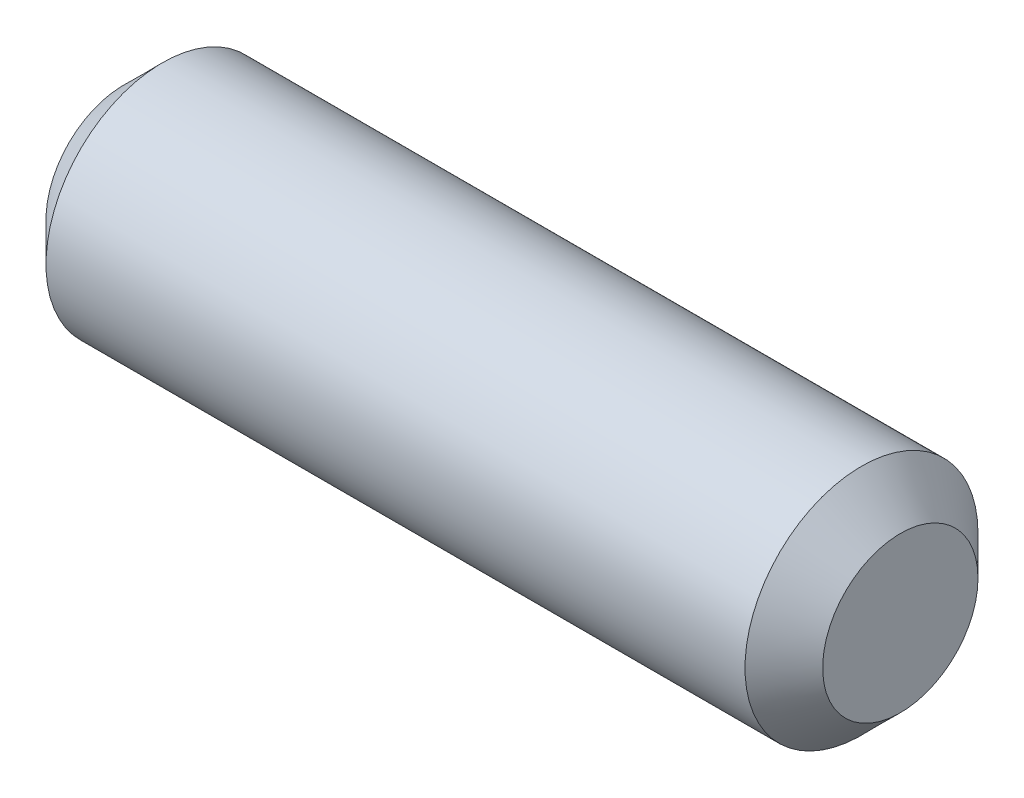
ISO-10303-21;
HEADER;
FILE_DESCRIPTION(('STEP AP214'),'2;1');
FILE_NAME('part.step','',(''),(''),'','','');
FILE_SCHEMA(('AUTOMOTIVE_DESIGN { 1 0 10303 214 1 1 1 1 }'));
ENDSEC;
DATA;
#1=APPLICATION_CONTEXT('core data for automotive mechanical design processes');
#2=APPLICATION_PROTOCOL_DEFINITION('international standard','automotive_design',2000,#1);
#3=PRODUCT_CONTEXT('',#1,'mechanical');
#4=PRODUCT('Part','Part','',(#3));
#5=PRODUCT_RELATED_PRODUCT_CATEGORY('part','',(#4));
#6=PRODUCT_DEFINITION_FORMATION('','',#4);
#7=PRODUCT_DEFINITION_CONTEXT('part definition',#1,'design');
#8=PRODUCT_DEFINITION('design','',#6,#7);
#9=PRODUCT_DEFINITION_SHAPE('','',#8);
#10=(LENGTH_UNIT() NAMED_UNIT(*) SI_UNIT(.MILLI.,.METRE.));
#11=(NAMED_UNIT(*) PLANE_ANGLE_UNIT() SI_UNIT($,.RADIAN.));
#12=(NAMED_UNIT(*) SI_UNIT($,.STERADIAN.) SOLID_ANGLE_UNIT());
#13=UNCERTAINTY_MEASURE_WITH_UNIT(LENGTH_MEASURE(1.E-05),#10,'distance_accuracy_value','');
#14=(GEOMETRIC_REPRESENTATION_CONTEXT(3) GLOBAL_UNCERTAINTY_ASSIGNED_CONTEXT((#13)) GLOBAL_UNIT_ASSIGNED_CONTEXT((#10,
#11,#12)) REPRESENTATION_CONTEXT('',''));
#15=CARTESIAN_POINT('',(0.,0.,0.));
#16=DIRECTION('',(0.,0.,1.));
#17=DIRECTION('',(1.,0.,0.));
#18=AXIS2_PLACEMENT_3D('',#15,#16,#17);
#19=CARTESIAN_POINT('',(5.,0.,0.));
#20=DIRECTION('',(-1.,0.,0.));
#21=DIRECTION('',(0.,0.,1.));
#22=AXIS2_PLACEMENT_3D('',#19,#20,#21);
#23=CYLINDRICAL_SURFACE('',#22,1.5);
#24=CARTESIAN_POINT('',(-4.5,0.,0.));
#25=DIRECTION('',(1.,0.,0.));
#26=DIRECTION('',(0.,0.,-1.));
#27=AXIS2_PLACEMENT_3D('',#24,#25,#26);
#28=CIRCLE('',#27,1.5);
#29=CARTESIAN_POINT('',(-4.5,0.,-1.5));
#30=VERTEX_POINT('',#29);
#31=EDGE_CURVE('E43',#30,#30,#28,.T.);
#32=ORIENTED_EDGE('',*,*,#31,.T.);
#33=EDGE_LOOP('',(#32));
#34=FACE_BOUND('',#33,.T.);
#35=CARTESIAN_POINT('',(4.5,0.,0.));
#36=DIRECTION('',(1.,0.,0.));
#37=DIRECTION('',(0.,0.,-1.));
#38=AXIS2_PLACEMENT_3D('',#35,#36,#37);
#39=CIRCLE('',#38,1.5);
#40=CARTESIAN_POINT('',(4.5,0.,-1.5));
#41=VERTEX_POINT('',#40);
#42=EDGE_CURVE('E47',#41,#41,#39,.F.);
#43=ORIENTED_EDGE('',*,*,#42,.T.);
#44=EDGE_LOOP('',(#43));
#45=FACE_BOUND('',#44,.T.);
#46=ADVANCED_FACE('F32',(#34,#45),#23,.T.);
#47=CARTESIAN_POINT('',(5.,0.,0.));
#48=DIRECTION('',(1.,0.,0.));
#49=DIRECTION('',(0.,0.,-1.));
#50=AXIS2_PLACEMENT_3D('',#47,#48,#49);
#51=PLANE('',#50);
#52=CARTESIAN_POINT('',(5.,0.,0.));
#53=DIRECTION('',(1.,0.,0.));
#54=DIRECTION('',(0.,0.,-1.));
#55=AXIS2_PLACEMENT_3D('',#52,#53,#54);
#56=CIRCLE('',#55,1.);
#57=CARTESIAN_POINT('',(5.,0.,-1.));
#58=VERTEX_POINT('',#57);
#59=EDGE_CURVE('E10',#58,#58,#56,.T.);
#60=ORIENTED_EDGE('',*,*,#59,.T.);
#61=EDGE_LOOP('',(#60));
#62=FACE_BOUND('',#61,.T.);
#63=ADVANCED_FACE('F63',(#62),#51,.T.);
#64=CARTESIAN_POINT('',(-5.,0.,0.));
#65=DIRECTION('',(1.,0.,0.));
#66=DIRECTION('',(0.,0.,-1.));
#67=AXIS2_PLACEMENT_3D('',#64,#65,#66);
#68=PLANE('',#67);
#69=CARTESIAN_POINT('',(-5.,0.,0.));
#70=DIRECTION('',(1.,0.,0.));
#71=DIRECTION('',(0.,0.,-1.));
#72=AXIS2_PLACEMENT_3D('',#69,#70,#71);
#73=CIRCLE('',#72,0.999999999999999);
#74=CARTESIAN_POINT('',(-5.,0.,-0.999999999999999));
#75=VERTEX_POINT('',#74);
#76=EDGE_CURVE('E39',#75,#75,#73,.F.);
#77=ORIENTED_EDGE('',*,*,#76,.T.);
#78=EDGE_LOOP('',(#77));
#79=FACE_BOUND('',#78,.T.);
#80=ADVANCED_FACE('F60',(#79),#68,.F.);
#81=CARTESIAN_POINT('',(-4.5,0.,0.));
#82=DIRECTION('',(1.,0.,0.));
#83=DIRECTION('',(0.,0.,-1.));
#84=AXIS2_PLACEMENT_3D('',#81,#82,#83);
#85=CONICAL_SURFACE('',#84,1.5,0.78539816339745);
#86=ORIENTED_EDGE('',*,*,#76,.F.);
#87=EDGE_LOOP('',(#86));
#88=FACE_BOUND('',#87,.T.);
#89=ORIENTED_EDGE('',*,*,#31,.F.);
#90=EDGE_LOOP('',(#89));
#91=FACE_BOUND('',#90,.T.);
#92=ADVANCED_FACE('F56',(#88,#91),#85,.T.);
#93=CARTESIAN_POINT('',(5.,0.,0.));
#94=DIRECTION('',(-1.,0.,0.));
#95=DIRECTION('',(0.,0.,1.));
#96=AXIS2_PLACEMENT_3D('',#93,#94,#95);
#97=CONICAL_SURFACE('',#96,1.,0.785398163397446);
#98=ORIENTED_EDGE('',*,*,#42,.F.);
#99=EDGE_LOOP('',(#98));
#100=FACE_BOUND('',#99,.T.);
#101=ORIENTED_EDGE('',*,*,#59,.F.);
#102=EDGE_LOOP('',(#101));
#103=FACE_BOUND('',#102,.T.);
#104=ADVANCED_FACE('F34',(#100,#103),#97,.T.);
#105=CLOSED_SHELL('',(#46,#63,#80,#92,#104));
#106=MANIFOLD_SOLID_BREP('B2',#105);
#107=ADVANCED_BREP_SHAPE_REPRESENTATION('',(#18,#106),#14);
#108=SHAPE_DEFINITION_REPRESENTATION(#9,#107);
ENDSEC;
END-ISO-10303-21;
